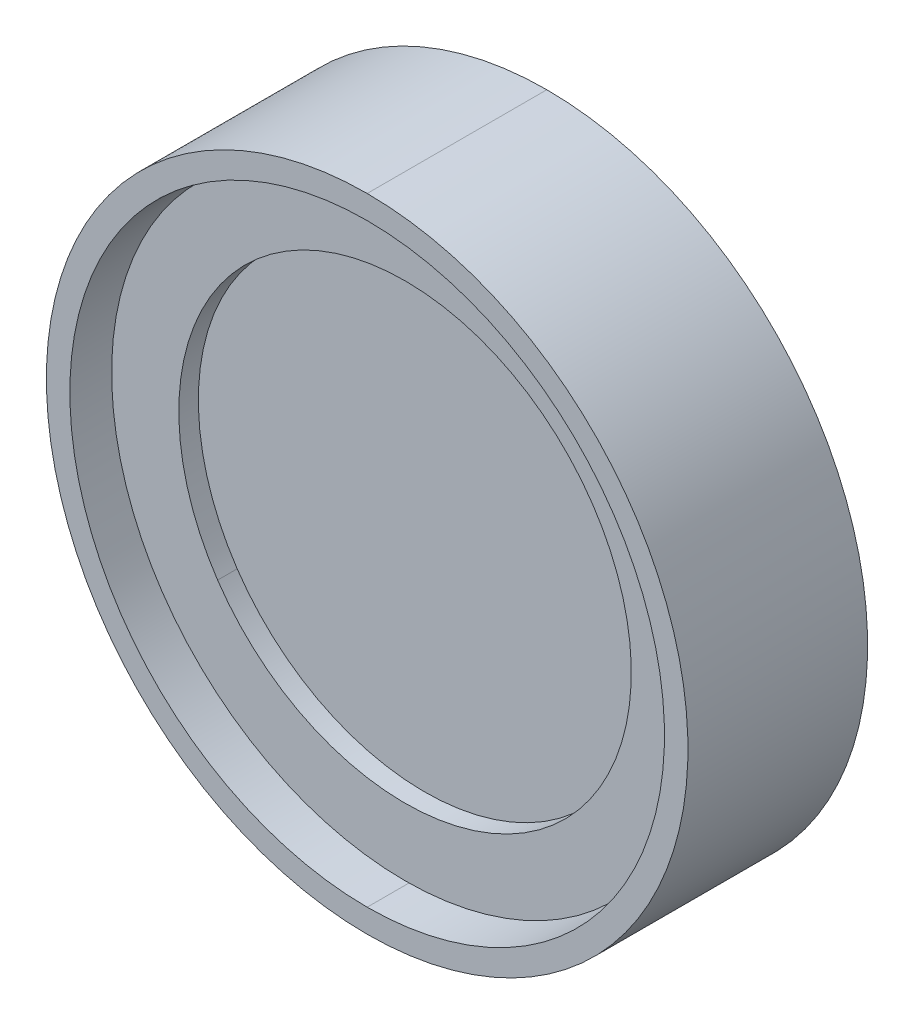
ISO-10303-21;
HEADER;
FILE_DESCRIPTION(('STEP AP214'),'2;1');
FILE_NAME('part.step','',(''),(''),'','','');
FILE_SCHEMA(('AUTOMOTIVE_DESIGN { 1 0 10303 214 1 1 1 1 }'));
ENDSEC;
DATA;
#1=APPLICATION_CONTEXT('core data for automotive mechanical design processes');
#2=APPLICATION_PROTOCOL_DEFINITION('international standard','automotive_design',2000,#1);
#3=PRODUCT_CONTEXT('',#1,'mechanical');
#4=PRODUCT('Part','Part','',(#3));
#5=PRODUCT_RELATED_PRODUCT_CATEGORY('part','',(#4));
#6=PRODUCT_DEFINITION_FORMATION('','',#4);
#7=PRODUCT_DEFINITION_CONTEXT('part definition',#1,'design');
#8=PRODUCT_DEFINITION('design','',#6,#7);
#9=PRODUCT_DEFINITION_SHAPE('','',#8);
#10=(LENGTH_UNIT() NAMED_UNIT(*) SI_UNIT(.MILLI.,.METRE.));
#11=(NAMED_UNIT(*) PLANE_ANGLE_UNIT() SI_UNIT($,.RADIAN.));
#12=(NAMED_UNIT(*) SI_UNIT($,.STERADIAN.) SOLID_ANGLE_UNIT());
#13=UNCERTAINTY_MEASURE_WITH_UNIT(LENGTH_MEASURE(1.E-05),#10,'distance_accuracy_value','');
#14=(GEOMETRIC_REPRESENTATION_CONTEXT(3) GLOBAL_UNCERTAINTY_ASSIGNED_CONTEXT((#13)) GLOBAL_UNIT_ASSIGNED_CONTEXT((#10,
#11,#12)) REPRESENTATION_CONTEXT('',''));
#15=CARTESIAN_POINT('',(0.,0.,0.));
#16=DIRECTION('',(0.,0.,1.));
#17=DIRECTION('',(1.,0.,0.));
#18=AXIS2_PLACEMENT_3D('',#15,#16,#17);
#19=CARTESIAN_POINT('',(0.,0.,0.));
#20=DIRECTION('',(0.,0.,-1.));
#21=DIRECTION('',(0.,1.,0.));
#22=AXIS2_PLACEMENT_3D('',#19,#20,#21);
#23=CYLINDRICAL_SURFACE('',#22,4.3434);
#24=CARTESIAN_POINT('',(0.,0.,0.381));
#25=DIRECTION('',(0.,0.,-1.));
#26=DIRECTION('',(0.,1.,0.));
#27=AXIS2_PLACEMENT_3D('',#24,#25,#26);
#28=CIRCLE('',#27,4.3434);
#29=CARTESIAN_POINT('',(0.,-4.3434,0.381));
#30=VERTEX_POINT('',#29);
#31=CARTESIAN_POINT('',(0.,4.3434,0.381));
#32=VERTEX_POINT('',#31);
#33=EDGE_CURVE('P0_E42',#30,#32,#28,.T.);
#34=ORIENTED_EDGE('',*,*,#33,.F.);
#35=DIRECTION('',(0.,0.,-1.));
#36=VECTOR('',#35,1.);
#37=CARTESIAN_POINT('',(0.,-4.3434,0.));
#38=LINE('',#37,#36);
#39=CARTESIAN_POINT('',(0.,-4.3434,0.));
#40=VERTEX_POINT('',#39);
#41=EDGE_CURVE('P0_E11',#30,#40,#38,.T.);
#42=ORIENTED_EDGE('',*,*,#41,.T.);
#43=CARTESIAN_POINT('',(0.,0.,0.));
#44=DIRECTION('',(0.,0.,-1.));
#45=DIRECTION('',(0.,1.,0.));
#46=AXIS2_PLACEMENT_3D('',#43,#44,#45);
#47=CIRCLE('',#46,4.3434);
#48=CARTESIAN_POINT('',(0.,4.3434,0.));
#49=VERTEX_POINT('',#48);
#50=EDGE_CURVE('P0_E28',#40,#49,#47,.T.);
#51=ORIENTED_EDGE('',*,*,#50,.T.);
#52=DIRECTION('',(0.,0.,-1.));
#53=VECTOR('',#52,1.);
#54=CARTESIAN_POINT('',(0.,4.3434,0.));
#55=LINE('',#54,#53);
#56=EDGE_CURVE('P0_E137',#32,#49,#55,.T.);
#57=ORIENTED_EDGE('',*,*,#56,.F.);
#58=EDGE_LOOP('',(#34,#42,#51,#57));
#59=FACE_BOUND('',#58,.T.);
#60=ADVANCED_FACE('P0_F17',(#59),#23,.F.);
#61=CARTESIAN_POINT('',(0.,0.,0.));
#62=DIRECTION('',(0.,0.,-1.));
#63=DIRECTION('',(0.,1.,0.));
#64=AXIS2_PLACEMENT_3D('',#61,#62,#63);
#65=CYLINDRICAL_SURFACE('',#64,5.8547);
#66=CARTESIAN_POINT('',(0.,0.,0.6858));
#67=DIRECTION('',(0.,0.,-1.));
#68=DIRECTION('',(0.,1.,0.));
#69=AXIS2_PLACEMENT_3D('',#66,#67,#68);
#70=CIRCLE('',#69,5.8547);
#71=CARTESIAN_POINT('',(0.,-5.8547,0.6858));
#72=VERTEX_POINT('',#71);
#73=CARTESIAN_POINT('',(0.,5.8547,0.6858));
#74=VERTEX_POINT('',#73);
#75=EDGE_CURVE('P0_E133',#72,#74,#70,.T.);
#76=ORIENTED_EDGE('',*,*,#75,.F.);
#77=DIRECTION('',(0.,0.,-1.));
#78=VECTOR('',#77,1.);
#79=CARTESIAN_POINT('',(0.,-5.8547,0.));
#80=LINE('',#79,#78);
#81=CARTESIAN_POINT('',(0.,-5.8547,0.381));
#82=VERTEX_POINT('',#81);
#83=EDGE_CURVE('P0_E148',#72,#82,#80,.T.);
#84=ORIENTED_EDGE('',*,*,#83,.T.);
#85=CARTESIAN_POINT('',(0.,0.,0.381));
#86=DIRECTION('',(0.,0.,-1.));
#87=DIRECTION('',(0.,1.,0.));
#88=AXIS2_PLACEMENT_3D('',#85,#86,#87);
#89=CIRCLE('',#88,5.8547);
#90=CARTESIAN_POINT('',(0.,5.8547,0.381));
#91=VERTEX_POINT('',#90);
#92=EDGE_CURVE('P0_E188',#82,#91,#89,.T.);
#93=ORIENTED_EDGE('',*,*,#92,.T.);
#94=DIRECTION('',(0.,0.,-1.));
#95=VECTOR('',#94,1.);
#96=CARTESIAN_POINT('',(0.,5.8547,0.));
#97=LINE('',#96,#95);
#98=EDGE_CURVE('P0_E176',#74,#91,#97,.T.);
#99=ORIENTED_EDGE('',*,*,#98,.F.);
#100=EDGE_LOOP('',(#76,#84,#93,#99));
#101=FACE_BOUND('',#100,.T.);
#102=ADVANCED_FACE('P0_F216',(#101),#65,.F.);
#103=CARTESIAN_POINT('',(0.,0.,0.));
#104=DIRECTION('',(0.,0.,-1.));
#105=DIRECTION('',(0.,1.,0.));
#106=AXIS2_PLACEMENT_3D('',#103,#104,#105);
#107=CYLINDRICAL_SURFACE('',#106,5.7912);
#108=CARTESIAN_POINT('',(0.,0.,3.5));
#109=DIRECTION('',(0.,0.,-1.));
#110=DIRECTION('',(0.,1.,0.));
#111=AXIS2_PLACEMENT_3D('',#108,#109,#110);
#112=CIRCLE('',#111,5.7912);
#113=CARTESIAN_POINT('',(0.,-5.7912,3.5));
#114=VERTEX_POINT('',#113);
#115=CARTESIAN_POINT('',(0.,5.7912,3.5));
#116=VERTEX_POINT('',#115);
#117=EDGE_CURVE('P0_E113',#114,#116,#112,.T.);
#118=ORIENTED_EDGE('',*,*,#117,.F.);
#119=DIRECTION('',(0.,0.,-1.));
#120=VECTOR('',#119,1.);
#121=CARTESIAN_POINT('',(0.,-5.7912,0.));
#122=LINE('',#121,#120);
#123=CARTESIAN_POINT('',(0.,-5.7912,0.6858));
#124=VERTEX_POINT('',#123);
#125=EDGE_CURVE('P0_E118',#114,#124,#122,.T.);
#126=ORIENTED_EDGE('',*,*,#125,.T.);
#127=CARTESIAN_POINT('',(0.,0.,0.6858));
#128=DIRECTION('',(0.,0.,-1.));
#129=DIRECTION('',(0.,1.,0.));
#130=AXIS2_PLACEMENT_3D('',#127,#128,#129);
#131=CIRCLE('',#130,5.7912);
#132=CARTESIAN_POINT('',(0.,5.7912,0.6858));
#133=VERTEX_POINT('',#132);
#134=EDGE_CURVE('P0_E116',#124,#133,#131,.T.);
#135=ORIENTED_EDGE('',*,*,#134,.T.);
#136=DIRECTION('',(0.,0.,-1.));
#137=VECTOR('',#136,1.);
#138=CARTESIAN_POINT('',(0.,5.7912,0.));
#139=LINE('',#138,#137);
#140=EDGE_CURVE('P0_E103',#116,#133,#139,.T.);
#141=ORIENTED_EDGE('',*,*,#140,.F.);
#142=EDGE_LOOP('',(#118,#126,#135,#141));
#143=FACE_BOUND('',#142,.T.);
#144=ADVANCED_FACE('P0_F117',(#143),#107,.F.);
#145=CARTESIAN_POINT('',(0.,0.,0.));
#146=DIRECTION('',(0.,0.,-1.));
#147=DIRECTION('',(0.,1.,0.));
#148=AXIS2_PLACEMENT_3D('',#145,#146,#147);
#149=CYLINDRICAL_SURFACE('',#148,6.2484);
#150=CARTESIAN_POINT('',(0.,0.,3.5));
#151=DIRECTION('',(0.,0.,-1.));
#152=DIRECTION('',(0.,1.,0.));
#153=AXIS2_PLACEMENT_3D('',#150,#151,#152);
#154=CIRCLE('',#153,6.2484);
#155=CARTESIAN_POINT('',(0.,6.2484,3.5));
#156=VERTEX_POINT('',#155);
#157=CARTESIAN_POINT('',(0.,-6.2484,3.5));
#158=VERTEX_POINT('',#157);
#159=EDGE_CURVE('P0_E121',#156,#158,#154,.T.);
#160=ORIENTED_EDGE('',*,*,#159,.T.);
#161=DIRECTION('',(0.,0.,-1.));
#162=VECTOR('',#161,1.);
#163=CARTESIAN_POINT('',(0.,-6.2484,0.));
#164=LINE('',#163,#162);
#165=CARTESIAN_POINT('',(0.,-6.2484,0.));
#166=VERTEX_POINT('',#165);
#167=EDGE_CURVE('P0_E73',#158,#166,#164,.T.);
#168=ORIENTED_EDGE('',*,*,#167,.T.);
#169=CARTESIAN_POINT('',(0.,0.,0.));
#170=DIRECTION('',(0.,0.,-1.));
#171=DIRECTION('',(0.,1.,0.));
#172=AXIS2_PLACEMENT_3D('',#169,#170,#171);
#173=CIRCLE('',#172,6.2484);
#174=CARTESIAN_POINT('',(0.,6.2484,0.));
#175=VERTEX_POINT('',#174);
#176=EDGE_CURVE('P0_E86',#175,#166,#173,.T.);
#177=ORIENTED_EDGE('',*,*,#176,.F.);
#178=DIRECTION('',(0.,0.,-1.));
#179=VECTOR('',#178,1.);
#180=CARTESIAN_POINT('',(0.,6.2484,0.));
#181=LINE('',#180,#179);
#182=EDGE_CURVE('P0_E170',#156,#175,#181,.T.);
#183=ORIENTED_EDGE('',*,*,#182,.F.);
#184=EDGE_LOOP('',(#160,#168,#177,#183));
#185=FACE_BOUND('',#184,.T.);
#186=ADVANCED_FACE('P0_F226',(#185),#149,.T.);
#187=CARTESIAN_POINT('',(0.,4.3434,0.));
#188=DIRECTION('',(0.,0.,-1.));
#189=DIRECTION('',(-1.,0.,0.));
#190=AXIS2_PLACEMENT_3D('',#187,#188,#189);
#191=PLANE('',#190);
#192=ORIENTED_EDGE('',*,*,#176,.T.);
#193=CARTESIAN_POINT('',(0.,0.,0.));
#194=DIRECTION('',(0.,0.,-1.));
#195=DIRECTION('',(0.,1.,0.));
#196=AXIS2_PLACEMENT_3D('',#193,#194,#195);
#197=CIRCLE('',#196,6.2484);
#198=EDGE_CURVE('P0_E142',#166,#175,#197,.T.);
#199=ORIENTED_EDGE('',*,*,#198,.T.);
#200=EDGE_LOOP('',(#192,#199));
#201=FACE_BOUND('',#200,.T.);
#202=CARTESIAN_POINT('',(0.,0.,0.));
#203=DIRECTION('',(0.,0.,-1.));
#204=DIRECTION('',(0.,1.,0.));
#205=AXIS2_PLACEMENT_3D('',#202,#203,#204);
#206=CIRCLE('',#205,4.3434);
#207=EDGE_CURVE('P0_E152',#49,#40,#206,.T.);
#208=ORIENTED_EDGE('',*,*,#207,.F.);
#209=ORIENTED_EDGE('',*,*,#50,.F.);
#210=EDGE_LOOP('',(#208,#209));
#211=FACE_BOUND('',#210,.T.);
#212=ADVANCED_FACE('P0_F210',(#201,#211),#191,.T.);
#213=CARTESIAN_POINT('',(0.,0.,0.));
#214=DIRECTION('',(0.,0.,-1.));
#215=DIRECTION('',(0.,1.,0.));
#216=AXIS2_PLACEMENT_3D('',#213,#214,#215);
#217=CYLINDRICAL_SURFACE('',#216,6.2484);
#218=ORIENTED_EDGE('',*,*,#167,.F.);
#219=CARTESIAN_POINT('',(0.,0.,3.5));
#220=DIRECTION('',(0.,0.,-1.));
#221=DIRECTION('',(0.,1.,0.));
#222=AXIS2_PLACEMENT_3D('',#219,#220,#221);
#223=CIRCLE('',#222,6.2484);
#224=EDGE_CURVE('P0_E21',#158,#156,#223,.T.);
#225=ORIENTED_EDGE('',*,*,#224,.T.);
#226=ORIENTED_EDGE('',*,*,#182,.T.);
#227=ORIENTED_EDGE('',*,*,#198,.F.);
#228=EDGE_LOOP('',(#218,#225,#226,#227));
#229=FACE_BOUND('',#228,.T.);
#230=ADVANCED_FACE('P0_F202',(#229),#217,.T.);
#231=CARTESIAN_POINT('',(0.,5.7912,3.5));
#232=DIRECTION('',(0.,0.,1.));
#233=DIRECTION('',(1.,0.,0.));
#234=AXIS2_PLACEMENT_3D('',#231,#232,#233);
#235=PLANE('',#234);
#236=ORIENTED_EDGE('',*,*,#159,.F.);
#237=ORIENTED_EDGE('',*,*,#224,.F.);
#238=EDGE_LOOP('',(#236,#237));
#239=FACE_BOUND('',#238,.T.);
#240=CARTESIAN_POINT('',(0.,0.,3.5));
#241=DIRECTION('',(0.,0.,-1.));
#242=DIRECTION('',(0.,1.,0.));
#243=AXIS2_PLACEMENT_3D('',#240,#241,#242);
#244=CIRCLE('',#243,5.7912);
#245=EDGE_CURVE('P0_E109',#116,#114,#244,.T.);
#246=ORIENTED_EDGE('',*,*,#245,.T.);
#247=ORIENTED_EDGE('',*,*,#117,.T.);
#248=EDGE_LOOP('',(#246,#247));
#249=FACE_BOUND('',#248,.T.);
#250=ADVANCED_FACE('P0_F200',(#239,#249),#235,.T.);
#251=CARTESIAN_POINT('',(0.,0.,0.));
#252=DIRECTION('',(0.,0.,-1.));
#253=DIRECTION('',(0.,1.,0.));
#254=AXIS2_PLACEMENT_3D('',#251,#252,#253);
#255=CYLINDRICAL_SURFACE('',#254,5.7912);
#256=ORIENTED_EDGE('',*,*,#125,.F.);
#257=ORIENTED_EDGE('',*,*,#245,.F.);
#258=ORIENTED_EDGE('',*,*,#140,.T.);
#259=CARTESIAN_POINT('',(0.,0.,0.6858));
#260=DIRECTION('',(0.,0.,-1.));
#261=DIRECTION('',(0.,1.,0.));
#262=AXIS2_PLACEMENT_3D('',#259,#260,#261);
#263=CIRCLE('',#262,5.7912);
#264=EDGE_CURVE('P0_E107',#133,#124,#263,.T.);
#265=ORIENTED_EDGE('',*,*,#264,.T.);
#266=EDGE_LOOP('',(#256,#257,#258,#265));
#267=FACE_BOUND('',#266,.T.);
#268=ADVANCED_FACE('P0_F19',(#267),#255,.F.);
#269=CARTESIAN_POINT('',(0.,5.7912,0.6858));
#270=DIRECTION('',(0.,0.,-1.));
#271=DIRECTION('',(-1.,0.,0.));
#272=AXIS2_PLACEMENT_3D('',#269,#270,#271);
#273=PLANE('',#272);
#274=CARTESIAN_POINT('',(0.,0.,0.6858));
#275=DIRECTION('',(0.,0.,-1.));
#276=DIRECTION('',(0.,1.,0.));
#277=AXIS2_PLACEMENT_3D('',#274,#275,#276);
#278=CIRCLE('',#277,5.8547);
#279=EDGE_CURVE('P0_E125',#74,#72,#278,.T.);
#280=ORIENTED_EDGE('',*,*,#279,.T.);
#281=ORIENTED_EDGE('',*,*,#75,.T.);
#282=EDGE_LOOP('',(#280,#281));
#283=FACE_BOUND('',#282,.T.);
#284=ORIENTED_EDGE('',*,*,#264,.F.);
#285=ORIENTED_EDGE('',*,*,#134,.F.);
#286=EDGE_LOOP('',(#284,#285));
#287=FACE_BOUND('',#286,.T.);
#288=ADVANCED_FACE('P0_F123',(#283,#287),#273,.T.);
#289=CARTESIAN_POINT('',(0.,0.,0.));
#290=DIRECTION('',(0.,0.,-1.));
#291=DIRECTION('',(0.,1.,0.));
#292=AXIS2_PLACEMENT_3D('',#289,#290,#291);
#293=CYLINDRICAL_SURFACE('',#292,5.8547);
#294=ORIENTED_EDGE('',*,*,#83,.F.);
#295=ORIENTED_EDGE('',*,*,#279,.F.);
#296=ORIENTED_EDGE('',*,*,#98,.T.);
#297=CARTESIAN_POINT('',(0.,0.,0.381));
#298=DIRECTION('',(0.,0.,-1.));
#299=DIRECTION('',(0.,1.,0.));
#300=AXIS2_PLACEMENT_3D('',#297,#298,#299);
#301=CIRCLE('',#300,5.8547);
#302=EDGE_CURVE('P0_E141',#91,#82,#301,.T.);
#303=ORIENTED_EDGE('',*,*,#302,.T.);
#304=EDGE_LOOP('',(#294,#295,#296,#303));
#305=FACE_BOUND('',#304,.T.);
#306=ADVANCED_FACE('P0_F230',(#305),#293,.F.);
#307=CARTESIAN_POINT('',(0.,4.3434,0.381));
#308=DIRECTION('',(0.,0.,1.));
#309=DIRECTION('',(1.,0.,0.));
#310=AXIS2_PLACEMENT_3D('',#307,#308,#309);
#311=PLANE('',#310);
#312=ORIENTED_EDGE('',*,*,#302,.F.);
#313=ORIENTED_EDGE('',*,*,#92,.F.);
#314=EDGE_LOOP('',(#312,#313));
#315=FACE_BOUND('',#314,.T.);
#316=CARTESIAN_POINT('',(0.,0.,0.381));
#317=DIRECTION('',(0.,0.,-1.));
#318=DIRECTION('',(0.,1.,0.));
#319=AXIS2_PLACEMENT_3D('',#316,#317,#318);
#320=CIRCLE('',#319,4.3434);
#321=EDGE_CURVE('P0_E138',#32,#30,#320,.T.);
#322=ORIENTED_EDGE('',*,*,#321,.T.);
#323=ORIENTED_EDGE('',*,*,#33,.T.);
#324=EDGE_LOOP('',(#322,#323));
#325=FACE_BOUND('',#324,.T.);
#326=ADVANCED_FACE('P0_F227',(#315,#325),#311,.T.);
#327=CARTESIAN_POINT('',(0.,0.,0.));
#328=DIRECTION('',(0.,0.,-1.));
#329=DIRECTION('',(0.,1.,0.));
#330=AXIS2_PLACEMENT_3D('',#327,#328,#329);
#331=CYLINDRICAL_SURFACE('',#330,4.3434);
#332=ORIENTED_EDGE('',*,*,#41,.F.);
#333=ORIENTED_EDGE('',*,*,#321,.F.);
#334=ORIENTED_EDGE('',*,*,#56,.T.);
#335=ORIENTED_EDGE('',*,*,#207,.T.);
#336=EDGE_LOOP('',(#332,#333,#334,#335));
#337=FACE_BOUND('',#336,.T.);
#338=ADVANCED_FACE('P0_F229',(#337),#331,.F.);
#339=CLOSED_SHELL('',(#60,#102,#144,#186,#212,#230,#250,#268,#288,#306,#326,#338));
#340=MANIFOLD_SOLID_BREP('P0_B1',#339);
#341=CARTESIAN_POINT('',(0.,0.,2.381));
#342=DIRECTION('',(0.,0.,1.));
#343=DIRECTION('',(0.828414208466952,0.560115969429611,0.));
#344=AXIS2_PLACEMENT_3D('',#341,#342,#343);
#345=CYLINDRICAL_SURFACE('',#344,4.4069);
#346=CARTESIAN_POINT('',(0.,0.,2.381));
#347=DIRECTION('',(0.,0.,1.));
#348=DIRECTION('',(0.828414208466952,0.560115969429611,0.));
#349=AXIS2_PLACEMENT_3D('',#346,#347,#348);
#350=CIRCLE('',#349,4.4069);
#351=CARTESIAN_POINT('',(-3.65073857529301,-2.46837506567935,2.381));
#352=VERTEX_POINT('',#351);
#353=CARTESIAN_POINT('',(3.65073857529301,2.46837506567935,2.381));
#354=VERTEX_POINT('',#353);
#355=EDGE_CURVE('P1_E40',#352,#354,#350,.T.);
#356=ORIENTED_EDGE('',*,*,#355,.F.);
#357=DIRECTION('',(0.,0.,1.));
#358=VECTOR('',#357,1.);
#359=CARTESIAN_POINT('',(-3.65073857529301,-2.46837506567935,2.381));
#360=LINE('',#359,#358);
#361=CARTESIAN_POINT('',(-3.65073857529301,-2.46837506567935,2.762));
#362=VERTEX_POINT('',#361);
#363=EDGE_CURVE('P1_E10',#352,#362,#360,.T.);
#364=ORIENTED_EDGE('',*,*,#363,.T.);
#365=CARTESIAN_POINT('',(0.,0.,2.762));
#366=DIRECTION('',(0.,0.,1.));
#367=DIRECTION('',(0.828414208466952,0.560115969429611,0.));
#368=AXIS2_PLACEMENT_3D('',#365,#366,#367);
#369=CIRCLE('',#368,4.4069);
#370=CARTESIAN_POINT('',(3.65073857529301,2.46837506567935,2.762));
#371=VERTEX_POINT('',#370);
#372=EDGE_CURVE('P1_E27',#362,#371,#369,.T.);
#373=ORIENTED_EDGE('',*,*,#372,.T.);
#374=DIRECTION('',(0.,0.,1.));
#375=VECTOR('',#374,1.);
#376=CARTESIAN_POINT('',(3.65073857529301,2.46837506567935,2.381));
#377=LINE('',#376,#375);
#378=EDGE_CURVE('P1_E20',#354,#371,#377,.T.);
#379=ORIENTED_EDGE('',*,*,#378,.F.);
#380=EDGE_LOOP('',(#356,#364,#373,#379));
#381=FACE_BOUND('',#380,.T.);
#382=ADVANCED_FACE('P1_F16',(#381),#345,.F.);
#383=CARTESIAN_POINT('',(0.,0.,2.381));
#384=DIRECTION('',(0.,0.,1.));
#385=DIRECTION('',(0.828414208466952,0.560115969429611,0.));
#386=AXIS2_PLACEMENT_3D('',#383,#384,#385);
#387=CYLINDRICAL_SURFACE('',#386,5.715);
#388=CARTESIAN_POINT('',(0.,0.,2.381));
#389=DIRECTION('',(0.,0.,1.));
#390=DIRECTION('',(0.828414208466952,0.560115969429611,0.));
#391=AXIS2_PLACEMENT_3D('',#388,#389,#390);
#392=CIRCLE('',#391,5.715);
#393=CARTESIAN_POINT('',(4.73438720138863,3.20106276529023,2.381));
#394=VERTEX_POINT('',#393);
#395=CARTESIAN_POINT('',(-4.73438720138863,-3.20106276529023,2.381));
#396=VERTEX_POINT('',#395);
#397=EDGE_CURVE('P1_E78',#394,#396,#392,.T.);
#398=ORIENTED_EDGE('',*,*,#397,.T.);
#399=DIRECTION('',(0.,0.,1.));
#400=VECTOR('',#399,1.);
#401=CARTESIAN_POINT('',(-4.73438720138863,-3.20106276529023,2.381));
#402=LINE('',#401,#400);
#403=CARTESIAN_POINT('',(-4.73438720138863,-3.20106276529023,2.762));
#404=VERTEX_POINT('',#403);
#405=EDGE_CURVE('P1_E91',#396,#404,#402,.T.);
#406=ORIENTED_EDGE('',*,*,#405,.T.);
#407=CARTESIAN_POINT('',(0.,0.,2.762));
#408=DIRECTION('',(0.,0.,1.));
#409=DIRECTION('',(0.828414208466952,0.560115969429611,0.));
#410=AXIS2_PLACEMENT_3D('',#407,#408,#409);
#411=CIRCLE('',#410,5.715);
#412=CARTESIAN_POINT('',(4.73438720138863,3.20106276529023,2.762));
#413=VERTEX_POINT('',#412);
#414=EDGE_CURVE('P1_E69',#413,#404,#411,.T.);
#415=ORIENTED_EDGE('',*,*,#414,.F.);
#416=DIRECTION('',(0.,0.,1.));
#417=VECTOR('',#416,1.);
#418=CARTESIAN_POINT('',(4.73438720138863,3.20106276529023,2.381));
#419=LINE('',#418,#417);
#420=EDGE_CURVE('P1_E75',#394,#413,#419,.T.);
#421=ORIENTED_EDGE('',*,*,#420,.F.);
#422=EDGE_LOOP('',(#398,#406,#415,#421));
#423=FACE_BOUND('',#422,.T.);
#424=ADVANCED_FACE('P1_F77',(#423),#387,.T.);
#425=CARTESIAN_POINT('',(0.,0.,2.381));
#426=DIRECTION('',(0.,0.,1.));
#427=DIRECTION('',(0.828414208466952,0.560115969429611,0.));
#428=AXIS2_PLACEMENT_3D('',#425,#426,#427);
#429=CYLINDRICAL_SURFACE('',#428,5.715);
#430=ORIENTED_EDGE('',*,*,#405,.F.);
#431=CARTESIAN_POINT('',(0.,0.,2.381));
#432=DIRECTION('',(0.,0.,1.));
#433=DIRECTION('',(0.828414208466952,0.560115969429611,0.));
#434=AXIS2_PLACEMENT_3D('',#431,#432,#433);
#435=CIRCLE('',#434,5.715);
#436=EDGE_CURVE('P1_E85',#396,#394,#435,.T.);
#437=ORIENTED_EDGE('',*,*,#436,.T.);
#438=ORIENTED_EDGE('',*,*,#420,.T.);
#439=CARTESIAN_POINT('',(0.,0.,2.762));
#440=DIRECTION('',(0.,0.,1.));
#441=DIRECTION('',(0.828414208466952,0.560115969429611,0.));
#442=AXIS2_PLACEMENT_3D('',#439,#440,#441);
#443=CIRCLE('',#442,5.715);
#444=EDGE_CURVE('P1_E263',#404,#413,#443,.T.);
#445=ORIENTED_EDGE('',*,*,#444,.F.);
#446=EDGE_LOOP('',(#430,#437,#438,#445));
#447=FACE_BOUND('',#446,.T.);
#448=ADVANCED_FACE('P1_F93',(#447),#429,.T.);
#449=CARTESIAN_POINT('',(0.,0.,2.381));
#450=DIRECTION('',(0.,0.,1.));
#451=DIRECTION('',(0.828414208466952,0.560115969429611,0.));
#452=AXIS2_PLACEMENT_3D('',#449,#450,#451);
#453=PLANE('',#452);
#454=ORIENTED_EDGE('',*,*,#397,.F.);
#455=ORIENTED_EDGE('',*,*,#436,.F.);
#456=EDGE_LOOP('',(#454,#455));
#457=FACE_BOUND('',#456,.T.);
#458=CARTESIAN_POINT('',(0.,0.,2.381));
#459=DIRECTION('',(0.,0.,1.));
#460=DIRECTION('',(0.828414208466952,0.560115969429611,0.));
#461=AXIS2_PLACEMENT_3D('',#458,#459,#460);
#462=CIRCLE('',#461,4.4069);
#463=EDGE_CURVE('P1_E86',#354,#352,#462,.T.);
#464=ORIENTED_EDGE('',*,*,#463,.T.);
#465=ORIENTED_EDGE('',*,*,#355,.T.);
#466=EDGE_LOOP('',(#464,#465));
#467=FACE_BOUND('',#466,.T.);
#468=ADVANCED_FACE('P1_F18',(#457,#467),#453,.F.);
#469=CARTESIAN_POINT('',(0.,0.,2.762));
#470=DIRECTION('',(0.,0.,1.));
#471=DIRECTION('',(0.828414208466952,0.560115969429611,0.));
#472=AXIS2_PLACEMENT_3D('',#469,#470,#471);
#473=PLANE('',#472);
#474=ORIENTED_EDGE('',*,*,#414,.T.);
#475=ORIENTED_EDGE('',*,*,#444,.T.);
#476=EDGE_LOOP('',(#474,#475));
#477=FACE_BOUND('',#476,.T.);
#478=CARTESIAN_POINT('',(0.,0.,2.762));
#479=DIRECTION('',(0.,0.,1.));
#480=DIRECTION('',(0.828414208466952,0.560115969429611,0.));
#481=AXIS2_PLACEMENT_3D('',#478,#479,#480);
#482=CIRCLE('',#481,4.4069);
#483=EDGE_CURVE('P1_E107',#371,#362,#482,.T.);
#484=ORIENTED_EDGE('',*,*,#483,.F.);
#485=ORIENTED_EDGE('',*,*,#372,.F.);
#486=EDGE_LOOP('',(#484,#485));
#487=FACE_BOUND('',#486,.T.);
#488=ADVANCED_FACE('P1_F120',(#477,#487),#473,.T.);
#489=CARTESIAN_POINT('',(0.,0.,2.381));
#490=DIRECTION('',(0.,0.,1.));
#491=DIRECTION('',(0.828414208466952,0.560115969429611,0.));
#492=AXIS2_PLACEMENT_3D('',#489,#490,#491);
#493=CYLINDRICAL_SURFACE('',#492,4.4069);
#494=ORIENTED_EDGE('',*,*,#363,.F.);
#495=ORIENTED_EDGE('',*,*,#463,.F.);
#496=ORIENTED_EDGE('',*,*,#378,.T.);
#497=ORIENTED_EDGE('',*,*,#483,.T.);
#498=EDGE_LOOP('',(#494,#495,#496,#497));
#499=FACE_BOUND('',#498,.T.);
#500=ADVANCED_FACE('P1_F117',(#499),#493,.F.);
#501=CLOSED_SHELL('',(#382,#424,#448,#468,#488,#500));
#502=MANIFOLD_SOLID_BREP('P1_B1',#501);
#503=CARTESIAN_POINT('',(0.,0.,2.381));
#504=DIRECTION('',(0.,0.,-1.));
#505=DIRECTION('',(-0.806844709706526,-0.590763585894215,0.));
#506=AXIS2_PLACEMENT_3D('',#503,#504,#505);
#507=CYLINDRICAL_SURFACE('',#506,5.7);
#508=CARTESIAN_POINT('',(0.,0.,2.381));
#509=DIRECTION('',(0.,0.,1.));
#510=DIRECTION('',(0.806844709706526,0.590763585894215,0.));
#511=AXIS2_PLACEMENT_3D('',#508,#509,#510);
#512=CIRCLE('',#511,5.7);
#513=CARTESIAN_POINT('',(4.5990148453272,3.36735243959702,2.381));
#514=VERTEX_POINT('',#513);
#515=CARTESIAN_POINT('',(-4.5990148453272,-3.36735243959702,2.381));
#516=VERTEX_POINT('',#515);
#517=EDGE_CURVE('P2_E40',#514,#516,#512,.T.);
#518=ORIENTED_EDGE('',*,*,#517,.F.);
#519=DIRECTION('',(0.,0.,-1.));
#520=VECTOR('',#519,1.);
#521=CARTESIAN_POINT('',(4.5990148453272,3.36735243959702,2.381));
#522=LINE('',#521,#520);
#523=CARTESIAN_POINT('',(4.5990148453272,3.36735243959702,0.381));
#524=VERTEX_POINT('',#523);
#525=EDGE_CURVE('P2_E11',#514,#524,#522,.T.);
#526=ORIENTED_EDGE('',*,*,#525,.T.);
#527=CARTESIAN_POINT('',(0.,0.,0.381));
#528=DIRECTION('',(0.,0.,1.));
#529=DIRECTION('',(0.806844709706526,0.590763585894215,0.));
#530=AXIS2_PLACEMENT_3D('',#527,#528,#529);
#531=CIRCLE('',#530,5.7);
#532=CARTESIAN_POINT('',(-4.5990148453272,-3.36735243959702,0.381));
#533=VERTEX_POINT('',#532);
#534=EDGE_CURVE('P2_E27',#524,#533,#531,.T.);
#535=ORIENTED_EDGE('',*,*,#534,.T.);
#536=DIRECTION('',(0.,0.,-1.));
#537=VECTOR('',#536,1.);
#538=CARTESIAN_POINT('',(-4.5990148453272,-3.36735243959702,2.381));
#539=LINE('',#538,#537);
#540=EDGE_CURVE('P2_E58',#516,#533,#539,.T.);
#541=ORIENTED_EDGE('',*,*,#540,.F.);
#542=EDGE_LOOP('',(#518,#526,#535,#541));
#543=FACE_BOUND('',#542,.T.);
#544=ADVANCED_FACE('P2_F17',(#543),#507,.T.);
#545=CARTESIAN_POINT('',(0.,0.,2.381));
#546=DIRECTION('',(0.,0.,-1.));
#547=DIRECTION('',(-0.806844709706526,-0.590763585894215,0.));
#548=AXIS2_PLACEMENT_3D('',#545,#546,#547);
#549=CYLINDRICAL_SURFACE('',#548,5.7);
#550=ORIENTED_EDGE('',*,*,#525,.F.);
#551=CARTESIAN_POINT('',(0.,0.,2.381));
#552=DIRECTION('',(0.,0.,1.));
#553=DIRECTION('',(0.806844709706526,0.590763585894215,0.));
#554=AXIS2_PLACEMENT_3D('',#551,#552,#553);
#555=CIRCLE('',#554,5.7);
#556=EDGE_CURVE('P2_E62',#516,#514,#555,.T.);
#557=ORIENTED_EDGE('',*,*,#556,.F.);
#558=ORIENTED_EDGE('',*,*,#540,.T.);
#559=CARTESIAN_POINT('',(0.,0.,0.381));
#560=DIRECTION('',(0.,0.,1.));
#561=DIRECTION('',(0.806844709706526,0.590763585894215,0.));
#562=AXIS2_PLACEMENT_3D('',#559,#560,#561);
#563=CIRCLE('',#562,5.7);
#564=EDGE_CURVE('P2_E20',#533,#524,#563,.T.);
#565=ORIENTED_EDGE('',*,*,#564,.T.);
#566=EDGE_LOOP('',(#550,#557,#558,#565));
#567=FACE_BOUND('',#566,.T.);
#568=ADVANCED_FACE('P2_F60',(#567),#549,.T.);
#569=CARTESIAN_POINT('',(0.,0.,2.381));
#570=DIRECTION('',(0.,0.,1.));
#571=DIRECTION('',(0.806844709706526,0.590763585894215,0.));
#572=AXIS2_PLACEMENT_3D('',#569,#570,#571);
#573=PLANE('',#572);
#574=ORIENTED_EDGE('',*,*,#556,.T.);
#575=ORIENTED_EDGE('',*,*,#517,.T.);
#576=EDGE_LOOP('',(#574,#575));
#577=FACE_BOUND('',#576,.T.);
#578=ADVANCED_FACE('P2_F92',(#577),#573,.T.);
#579=CARTESIAN_POINT('',(0.,0.,0.381));
#580=DIRECTION('',(0.,0.,1.));
#581=DIRECTION('',(0.806844709706526,0.590763585894215,0.));
#582=AXIS2_PLACEMENT_3D('',#579,#580,#581);
#583=PLANE('',#582);
#584=ORIENTED_EDGE('',*,*,#564,.F.);
#585=ORIENTED_EDGE('',*,*,#534,.F.);
#586=EDGE_LOOP('',(#584,#585));
#587=FACE_BOUND('',#586,.T.);
#588=ADVANCED_FACE('P2_F68',(#587),#583,.F.);
#589=CLOSED_SHELL('',(#544,#568,#578,#588));
#590=MANIFOLD_SOLID_BREP('P2_B1',#589);
#591=ADVANCED_BREP_SHAPE_REPRESENTATION('',(#18,#340,#502,#590),#14);
#592=SHAPE_DEFINITION_REPRESENTATION(#9,#591);
ENDSEC;
END-ISO-10303-21;
